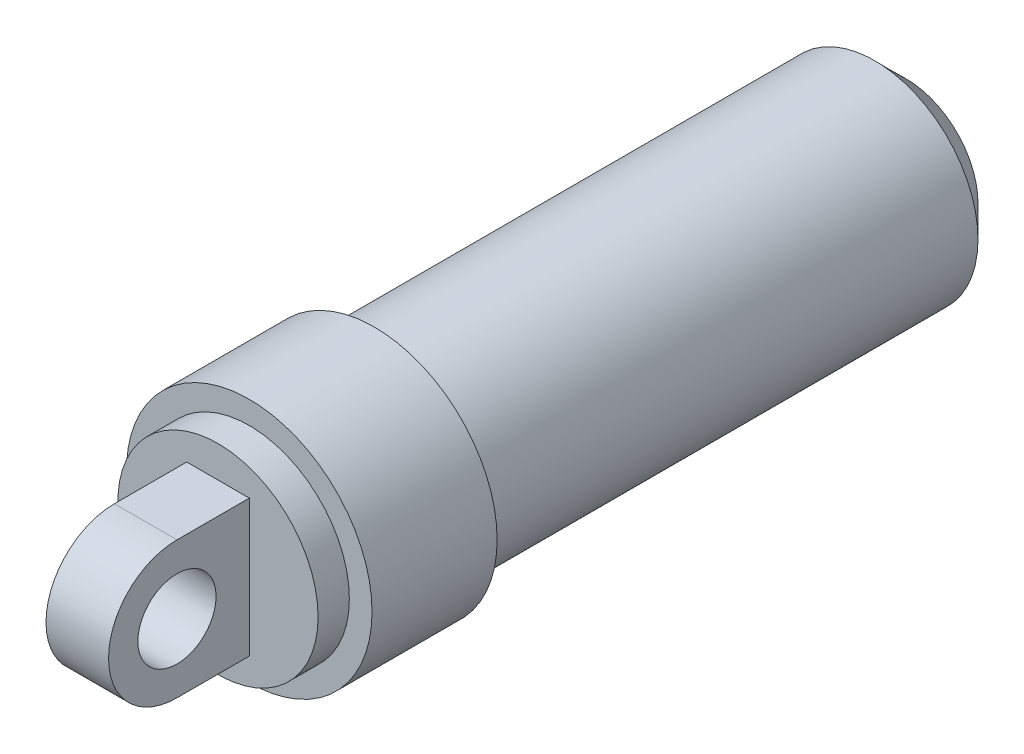
ISO-10303-21;
HEADER;
FILE_DESCRIPTION(('STEP AP214'),'2;1');
FILE_NAME('part.step','',(''),(''),'','','');
FILE_SCHEMA(('AUTOMOTIVE_DESIGN { 1 0 10303 214 1 1 1 1 }'));
ENDSEC;
DATA;
#1=APPLICATION_CONTEXT('core data for automotive mechanical design processes');
#2=APPLICATION_PROTOCOL_DEFINITION('international standard','automotive_design',2000,#1);
#3=PRODUCT_CONTEXT('',#1,'mechanical');
#4=PRODUCT('Part','Part','',(#3));
#5=PRODUCT_RELATED_PRODUCT_CATEGORY('part','',(#4));
#6=PRODUCT_DEFINITION_FORMATION('','',#4);
#7=PRODUCT_DEFINITION_CONTEXT('part definition',#1,'design');
#8=PRODUCT_DEFINITION('design','',#6,#7);
#9=PRODUCT_DEFINITION_SHAPE('','',#8);
#10=(LENGTH_UNIT() NAMED_UNIT(*) SI_UNIT(.MILLI.,.METRE.));
#11=(NAMED_UNIT(*) PLANE_ANGLE_UNIT() SI_UNIT($,.RADIAN.));
#12=(NAMED_UNIT(*) SI_UNIT($,.STERADIAN.) SOLID_ANGLE_UNIT());
#13=UNCERTAINTY_MEASURE_WITH_UNIT(LENGTH_MEASURE(1.E-05),#10,'distance_accuracy_value','');
#14=(GEOMETRIC_REPRESENTATION_CONTEXT(3) GLOBAL_UNCERTAINTY_ASSIGNED_CONTEXT((#13)) GLOBAL_UNIT_ASSIGNED_CONTEXT((#10,
#11,#12)) REPRESENTATION_CONTEXT('',''));
#15=CARTESIAN_POINT('',(0.,0.,0.));
#16=DIRECTION('',(0.,0.,1.));
#17=DIRECTION('',(1.,0.,0.));
#18=AXIS2_PLACEMENT_3D('',#15,#16,#17);
#19=CARTESIAN_POINT('',(0.,0.,44.));
#20=DIRECTION('',(0.,0.,1.));
#21=DIRECTION('',(1.,0.,0.));
#22=AXIS2_PLACEMENT_3D('',#19,#20,#21);
#23=PLANE('',#22);
#24=CARTESIAN_POINT('',(0.,0.,44.));
#25=DIRECTION('',(0.,0.,1.));
#26=DIRECTION('',(1.,0.,0.));
#27=AXIS2_PLACEMENT_3D('',#24,#25,#26);
#28=CIRCLE('',#27,6.4);
#29=CARTESIAN_POINT('',(6.4,0.,44.));
#30=VERTEX_POINT('',#29);
#31=EDGE_CURVE('E99',#30,#30,#28,.T.);
#32=ORIENTED_EDGE('',*,*,#31,.T.);
#33=EDGE_LOOP('',(#32));
#34=FACE_BOUND('',#33,.T.);
#35=DIRECTION('',(-1.,0.,0.));
#36=VECTOR('',#35,1.);
#37=CARTESIAN_POINT('',(2.,4.375,44.));
#38=LINE('',#37,#36);
#39=CARTESIAN_POINT('',(2.,4.375,44.));
#40=VERTEX_POINT('',#39);
#41=CARTESIAN_POINT('',(-2.,4.375,44.));
#42=VERTEX_POINT('',#41);
#43=EDGE_CURVE('E54',#40,#42,#38,.T.);
#44=ORIENTED_EDGE('',*,*,#43,.F.);
#45=DIRECTION('',(0.,1.,0.));
#46=VECTOR('',#45,1.);
#47=CARTESIAN_POINT('',(2.,-4.375,44.));
#48=LINE('',#47,#46);
#49=CARTESIAN_POINT('',(2.,-4.375,44.));
#50=VERTEX_POINT('',#49);
#51=EDGE_CURVE('E49',#50,#40,#48,.T.);
#52=ORIENTED_EDGE('',*,*,#51,.F.);
#53=DIRECTION('',(-1.,0.,0.));
#54=VECTOR('',#53,1.);
#55=CARTESIAN_POINT('',(2.,-4.375,44.));
#56=LINE('',#55,#54);
#57=CARTESIAN_POINT('',(-2.,-4.375,44.));
#58=VERTEX_POINT('',#57);
#59=EDGE_CURVE('E80',#50,#58,#56,.T.);
#60=ORIENTED_EDGE('',*,*,#59,.T.);
#61=DIRECTION('',(0.,1.,0.));
#62=VECTOR('',#61,1.);
#63=CARTESIAN_POINT('',(-2.,-4.375,44.));
#64=LINE('',#63,#62);
#65=EDGE_CURVE('E300',#58,#42,#64,.T.);
#66=ORIENTED_EDGE('',*,*,#65,.T.);
#67=EDGE_LOOP('',(#44,#52,#60,#66));
#68=FACE_BOUND('',#67,.T.);
#69=ADVANCED_FACE('F34',(#34,#68),#23,.T.);
#70=CARTESIAN_POINT('',(0.,0.,34.));
#71=DIRECTION('',(0.,0.,-1.));
#72=DIRECTION('',(-1.,0.,0.));
#73=AXIS2_PLACEMENT_3D('',#70,#71,#72);
#74=CYLINDRICAL_SURFACE('',#73,6.6);
#75=CARTESIAN_POINT('',(0.,0.,1.99999999999999));
#76=DIRECTION('',(0.,0.,1.));
#77=DIRECTION('',(1.,0.,0.));
#78=AXIS2_PLACEMENT_3D('',#75,#76,#77);
#79=CIRCLE('',#78,6.6);
#80=CARTESIAN_POINT('',(6.6,0.,1.99999999999999));
#81=VERTEX_POINT('',#80);
#82=EDGE_CURVE('E42',#81,#81,#79,.T.);
#83=ORIENTED_EDGE('',*,*,#82,.T.);
#84=EDGE_LOOP('',(#83));
#85=FACE_BOUND('',#84,.T.);
#86=CARTESIAN_POINT('',(0.,0.,34.));
#87=DIRECTION('',(0.,0.,1.));
#88=DIRECTION('',(1.,0.,0.));
#89=AXIS2_PLACEMENT_3D('',#86,#87,#88);
#90=CIRCLE('',#89,6.6);
#91=CARTESIAN_POINT('',(6.6,0.,34.));
#92=VERTEX_POINT('',#91);
#93=EDGE_CURVE('E110',#92,#92,#90,.T.);
#94=ORIENTED_EDGE('',*,*,#93,.F.);
#95=EDGE_LOOP('',(#94));
#96=FACE_BOUND('',#95,.T.);
#97=ADVANCED_FACE('F117',(#85,#96),#74,.T.);
#98=CARTESIAN_POINT('',(0.,0.,0.));
#99=DIRECTION('',(0.,0.,1.));
#100=DIRECTION('',(1.,0.,0.));
#101=AXIS2_PLACEMENT_3D('',#98,#99,#100);
#102=PLANE('',#101);
#103=CARTESIAN_POINT('',(0.,0.,0.));
#104=DIRECTION('',(0.,0.,-1.));
#105=DIRECTION('',(-1.,0.,0.));
#106=AXIS2_PLACEMENT_3D('',#103,#104,#105);
#107=CIRCLE('',#106,1.5);
#108=CARTESIAN_POINT('',(-1.5,0.,0.));
#109=VERTEX_POINT('',#108);
#110=EDGE_CURVE('E284',#109,#109,#107,.T.);
#111=ORIENTED_EDGE('',*,*,#110,.F.);
#112=EDGE_LOOP('',(#111));
#113=FACE_BOUND('',#112,.T.);
#114=CARTESIAN_POINT('',(0.,0.,0.));
#115=DIRECTION('',(0.,0.,1.));
#116=DIRECTION('',(1.,0.,0.));
#117=AXIS2_PLACEMENT_3D('',#114,#115,#116);
#118=CIRCLE('',#117,4.6);
#119=CARTESIAN_POINT('',(4.6,0.,0.));
#120=VERTEX_POINT('',#119);
#121=EDGE_CURVE('E11',#120,#120,#118,.F.);
#122=ORIENTED_EDGE('',*,*,#121,.T.);
#123=EDGE_LOOP('',(#122));
#124=FACE_BOUND('',#123,.T.);
#125=ADVANCED_FACE('F122',(#113,#124),#102,.F.);
#126=CARTESIAN_POINT('',(0.,0.,1.99999999999999));
#127=DIRECTION('',(0.,0.,1.));
#128=DIRECTION('',(1.,0.,0.));
#129=AXIS2_PLACEMENT_3D('',#126,#127,#128);
#130=CONICAL_SURFACE('',#129,6.6,0.785398163397451);
#131=ORIENTED_EDGE('',*,*,#121,.F.);
#132=EDGE_LOOP('',(#131));
#133=FACE_BOUND('',#132,.T.);
#134=ORIENTED_EDGE('',*,*,#82,.F.);
#135=EDGE_LOOP('',(#134));
#136=FACE_BOUND('',#135,.T.);
#137=ADVANCED_FACE('F36',(#133,#136),#130,.T.);
#138=CARTESIAN_POINT('',(0.,0.,42.));
#139=DIRECTION('',(0.,0.,-1.));
#140=DIRECTION('',(-1.,0.,0.));
#141=AXIS2_PLACEMENT_3D('',#138,#139,#140);
#142=CYLINDRICAL_SURFACE('',#141,7.85);
#143=CARTESIAN_POINT('',(0.,0.,42.));
#144=DIRECTION('',(0.,0.,1.));
#145=DIRECTION('',(1.,0.,0.));
#146=AXIS2_PLACEMENT_3D('',#143,#144,#145);
#147=CIRCLE('',#146,7.85);
#148=CARTESIAN_POINT('',(7.85,0.,42.));
#149=VERTEX_POINT('',#148);
#150=EDGE_CURVE('E107',#149,#149,#147,.T.);
#151=ORIENTED_EDGE('',*,*,#150,.F.);
#152=EDGE_LOOP('',(#151));
#153=FACE_BOUND('',#152,.T.);
#154=CARTESIAN_POINT('',(0.,0.,34.));
#155=DIRECTION('',(0.,0.,1.));
#156=DIRECTION('',(1.,0.,0.));
#157=AXIS2_PLACEMENT_3D('',#154,#155,#156);
#158=CIRCLE('',#157,7.85);
#159=CARTESIAN_POINT('',(7.85,0.,34.));
#160=VERTEX_POINT('',#159);
#161=EDGE_CURVE('E105',#160,#160,#158,.T.);
#162=ORIENTED_EDGE('',*,*,#161,.T.);
#163=EDGE_LOOP('',(#162));
#164=FACE_BOUND('',#163,.T.);
#165=ADVANCED_FACE('F121',(#153,#164),#142,.T.);
#166=CARTESIAN_POINT('',(0.,0.,42.));
#167=DIRECTION('',(0.,0.,1.));
#168=DIRECTION('',(1.,0.,0.));
#169=AXIS2_PLACEMENT_3D('',#166,#167,#168);
#170=PLANE('',#169);
#171=CARTESIAN_POINT('',(0.,0.,42.));
#172=DIRECTION('',(0.,0.,1.));
#173=DIRECTION('',(1.,0.,0.));
#174=AXIS2_PLACEMENT_3D('',#171,#172,#173);
#175=CIRCLE('',#174,6.4);
#176=CARTESIAN_POINT('',(6.4,0.,42.));
#177=VERTEX_POINT('',#176);
#178=EDGE_CURVE('E96',#177,#177,#175,.T.);
#179=ORIENTED_EDGE('',*,*,#178,.F.);
#180=EDGE_LOOP('',(#179));
#181=FACE_BOUND('',#180,.T.);
#182=ORIENTED_EDGE('',*,*,#150,.T.);
#183=EDGE_LOOP('',(#182));
#184=FACE_BOUND('',#183,.T.);
#185=ADVANCED_FACE('F128',(#181,#184),#170,.T.);
#186=CARTESIAN_POINT('',(0.,0.,34.));
#187=DIRECTION('',(0.,0.,1.));
#188=DIRECTION('',(1.,0.,0.));
#189=AXIS2_PLACEMENT_3D('',#186,#187,#188);
#190=PLANE('',#189);
#191=ORIENTED_EDGE('',*,*,#93,.T.);
#192=EDGE_LOOP('',(#191));
#193=FACE_BOUND('',#192,.T.);
#194=ORIENTED_EDGE('',*,*,#161,.F.);
#195=EDGE_LOOP('',(#194));
#196=FACE_BOUND('',#195,.T.);
#197=ADVANCED_FACE('F146',(#193,#196),#190,.F.);
#198=CARTESIAN_POINT('',(0.,0.,44.));
#199=DIRECTION('',(0.,0.,-1.));
#200=DIRECTION('',(-1.,0.,0.));
#201=AXIS2_PLACEMENT_3D('',#198,#199,#200);
#202=CYLINDRICAL_SURFACE('',#201,6.4);
#203=ORIENTED_EDGE('',*,*,#31,.F.);
#204=EDGE_LOOP('',(#203));
#205=FACE_BOUND('',#204,.T.);
#206=ORIENTED_EDGE('',*,*,#178,.T.);
#207=EDGE_LOOP('',(#206));
#208=FACE_BOUND('',#207,.T.);
#209=ADVANCED_FACE('F143',(#205,#208),#202,.T.);
#210=CARTESIAN_POINT('',(2.,0.,48.625));
#211=DIRECTION('',(-1.,0.,0.));
#212=DIRECTION('',(0.,0.,1.));
#213=AXIS2_PLACEMENT_3D('',#210,#211,#212);
#214=CYLINDRICAL_SURFACE('',#213,4.375);
#215=CARTESIAN_POINT('',(-2.,0.,48.625));
#216=DIRECTION('',(1.,0.,0.));
#217=DIRECTION('',(0.,0.,1.));
#218=AXIS2_PLACEMENT_3D('',#215,#216,#217);
#219=CIRCLE('',#218,4.375);
#220=CARTESIAN_POINT('',(-2.,4.375,48.625));
#221=VERTEX_POINT('',#220);
#222=CARTESIAN_POINT('',(-2.,-4.375,48.625));
#223=VERTEX_POINT('',#222);
#224=EDGE_CURVE('E95',#221,#223,#219,.T.);
#225=ORIENTED_EDGE('',*,*,#224,.T.);
#226=DIRECTION('',(-1.,0.,0.));
#227=VECTOR('',#226,1.);
#228=CARTESIAN_POINT('',(2.,-4.375,48.625));
#229=LINE('',#228,#227);
#230=CARTESIAN_POINT('',(2.,-4.375,48.625));
#231=VERTEX_POINT('',#230);
#232=EDGE_CURVE('E78',#231,#223,#229,.T.);
#233=ORIENTED_EDGE('',*,*,#232,.F.);
#234=CARTESIAN_POINT('',(2.,0.,48.625));
#235=DIRECTION('',(1.,0.,0.));
#236=DIRECTION('',(0.,0.,1.));
#237=AXIS2_PLACEMENT_3D('',#234,#235,#236);
#238=CIRCLE('',#237,4.375);
#239=CARTESIAN_POINT('',(2.,4.375,48.625));
#240=VERTEX_POINT('',#239);
#241=EDGE_CURVE('E82',#240,#231,#238,.T.);
#242=ORIENTED_EDGE('',*,*,#241,.F.);
#243=DIRECTION('',(-1.,0.,0.));
#244=VECTOR('',#243,1.);
#245=CARTESIAN_POINT('',(2.,4.375,48.625));
#246=LINE('',#245,#244);
#247=EDGE_CURVE('E296',#240,#221,#246,.T.);
#248=ORIENTED_EDGE('',*,*,#247,.T.);
#249=EDGE_LOOP('',(#225,#233,#242,#248));
#250=FACE_BOUND('',#249,.T.);
#251=ADVANCED_FACE('F93',(#250),#214,.T.);
#252=CARTESIAN_POINT('',(2.,-4.375,48.625));
#253=DIRECTION('',(0.,1.,0.));
#254=DIRECTION('',(0.,0.,1.));
#255=AXIS2_PLACEMENT_3D('',#252,#253,#254);
#256=PLANE('',#255);
#257=DIRECTION('',(0.,0.,-1.));
#258=VECTOR('',#257,1.);
#259=CARTESIAN_POINT('',(-2.,-4.375,48.625));
#260=LINE('',#259,#258);
#261=EDGE_CURVE('E298',#223,#58,#260,.T.);
#262=ORIENTED_EDGE('',*,*,#261,.T.);
#263=ORIENTED_EDGE('',*,*,#59,.F.);
#264=DIRECTION('',(0.,0.,-1.));
#265=VECTOR('',#264,1.);
#266=CARTESIAN_POINT('',(2.,-4.375,48.625));
#267=LINE('',#266,#265);
#268=EDGE_CURVE('E73',#231,#50,#267,.T.);
#269=ORIENTED_EDGE('',*,*,#268,.F.);
#270=ORIENTED_EDGE('',*,*,#232,.T.);
#271=EDGE_LOOP('',(#262,#263,#269,#270));
#272=FACE_BOUND('',#271,.T.);
#273=ADVANCED_FACE('F76',(#272),#256,.F.);
#274=CARTESIAN_POINT('',(2.,4.375,44.));
#275=DIRECTION('',(0.,-1.,0.));
#276=DIRECTION('',(0.,0.,-1.));
#277=AXIS2_PLACEMENT_3D('',#274,#275,#276);
#278=PLANE('',#277);
#279=DIRECTION('',(0.,0.,1.));
#280=VECTOR('',#279,1.);
#281=CARTESIAN_POINT('',(-2.,4.375,44.));
#282=LINE('',#281,#280);
#283=EDGE_CURVE('E91',#42,#221,#282,.T.);
#284=ORIENTED_EDGE('',*,*,#283,.T.);
#285=ORIENTED_EDGE('',*,*,#247,.F.);
#286=DIRECTION('',(0.,0.,1.));
#287=VECTOR('',#286,1.);
#288=CARTESIAN_POINT('',(2.,4.375,44.));
#289=LINE('',#288,#287);
#290=EDGE_CURVE('E87',#40,#240,#289,.T.);
#291=ORIENTED_EDGE('',*,*,#290,.F.);
#292=ORIENTED_EDGE('',*,*,#43,.T.);
#293=EDGE_LOOP('',(#284,#285,#291,#292));
#294=FACE_BOUND('',#293,.T.);
#295=ADVANCED_FACE('F177',(#294),#278,.F.);
#296=CARTESIAN_POINT('',(2.,0.,48.625));
#297=DIRECTION('',(-1.,0.,0.));
#298=DIRECTION('',(0.,0.,1.));
#299=AXIS2_PLACEMENT_3D('',#296,#297,#298);
#300=PLANE('',#299);
#301=CARTESIAN_POINT('',(2.,0.,48.625));
#302=DIRECTION('',(-1.,0.,0.));
#303=DIRECTION('',(0.,0.,1.));
#304=AXIS2_PLACEMENT_3D('',#301,#302,#303);
#305=CIRCLE('',#304,2.5);
#306=CARTESIAN_POINT('',(2.,0.,51.125));
#307=VERTEX_POINT('',#306);
#308=EDGE_CURVE('E287',#307,#307,#305,.T.);
#309=ORIENTED_EDGE('',*,*,#308,.T.);
#310=EDGE_LOOP('',(#309));
#311=FACE_BOUND('',#310,.T.);
#312=ORIENTED_EDGE('',*,*,#241,.T.);
#313=ORIENTED_EDGE('',*,*,#268,.T.);
#314=ORIENTED_EDGE('',*,*,#51,.T.);
#315=ORIENTED_EDGE('',*,*,#290,.T.);
#316=EDGE_LOOP('',(#312,#313,#314,#315));
#317=FACE_BOUND('',#316,.T.);
#318=ADVANCED_FACE('F85',(#311,#317),#300,.F.);
#319=CARTESIAN_POINT('',(-2.,0.,48.625));
#320=DIRECTION('',(-1.,0.,0.));
#321=DIRECTION('',(0.,0.,1.));
#322=AXIS2_PLACEMENT_3D('',#319,#320,#321);
#323=PLANE('',#322);
#324=CARTESIAN_POINT('',(-2.,0.,48.625));
#325=DIRECTION('',(-1.,0.,0.));
#326=DIRECTION('',(0.,0.,1.));
#327=AXIS2_PLACEMENT_3D('',#324,#325,#326);
#328=CIRCLE('',#327,2.5);
#329=CARTESIAN_POINT('',(-2.,0.,51.125));
#330=VERTEX_POINT('',#329);
#331=EDGE_CURVE('E283',#330,#330,#328,.T.);
#332=ORIENTED_EDGE('',*,*,#331,.F.);
#333=EDGE_LOOP('',(#332));
#334=FACE_BOUND('',#333,.T.);
#335=ORIENTED_EDGE('',*,*,#224,.F.);
#336=ORIENTED_EDGE('',*,*,#283,.F.);
#337=ORIENTED_EDGE('',*,*,#65,.F.);
#338=ORIENTED_EDGE('',*,*,#261,.F.);
#339=EDGE_LOOP('',(#335,#336,#337,#338));
#340=FACE_BOUND('',#339,.T.);
#341=ADVANCED_FACE('F190',(#334,#340),#323,.T.);
#342=CARTESIAN_POINT('',(2.,0.,48.625));
#343=DIRECTION('',(-1.,0.,0.));
#344=DIRECTION('',(0.,0.,1.));
#345=AXIS2_PLACEMENT_3D('',#342,#343,#344);
#346=CYLINDRICAL_SURFACE('',#345,2.5);
#347=ORIENTED_EDGE('',*,*,#308,.F.);
#348=EDGE_LOOP('',(#347));
#349=FACE_BOUND('',#348,.T.);
#350=ORIENTED_EDGE('',*,*,#331,.T.);
#351=EDGE_LOOP('',(#350));
#352=FACE_BOUND('',#351,.T.);
#353=ADVANCED_FACE('F198',(#349,#352),#346,.F.);
#354=CARTESIAN_POINT('',(0.,0.,35.));
#355=DIRECTION('',(0.,0.,-1.));
#356=DIRECTION('',(-1.,0.,0.));
#357=AXIS2_PLACEMENT_3D('',#354,#355,#356);
#358=CYLINDRICAL_SURFACE('',#357,1.5);
#359=CARTESIAN_POINT('',(0.,0.,35.));
#360=DIRECTION('',(0.,0.,-1.));
#361=DIRECTION('',(-1.,0.,0.));
#362=AXIS2_PLACEMENT_3D('',#359,#360,#361);
#363=CIRCLE('',#362,1.5);
#364=CARTESIAN_POINT('',(-1.5,0.,35.));
#365=VERTEX_POINT('',#364);
#366=EDGE_CURVE('E282',#365,#365,#363,.T.);
#367=ORIENTED_EDGE('',*,*,#366,.F.);
#368=EDGE_LOOP('',(#367));
#369=FACE_BOUND('',#368,.T.);
#370=ORIENTED_EDGE('',*,*,#110,.T.);
#371=EDGE_LOOP('',(#370));
#372=FACE_BOUND('',#371,.T.);
#373=ADVANCED_FACE('F206',(#369,#372),#358,.F.);
#374=CARTESIAN_POINT('',(0.,0.,35.));
#375=DIRECTION('',(0.,0.,-1.));
#376=DIRECTION('',(-1.,0.,0.));
#377=AXIS2_PLACEMENT_3D('',#374,#375,#376);
#378=PLANE('',#377);
#379=ORIENTED_EDGE('',*,*,#366,.T.);
#380=EDGE_LOOP('',(#379));
#381=FACE_BOUND('',#380,.T.);
#382=ADVANCED_FACE('F215',(#381),#378,.T.);
#383=CLOSED_SHELL('',(#69,#97,#125,#137,#165,#185,#197,#209,#251,#273,#295,#318,#341,#353,#373,#382));
#384=MANIFOLD_SOLID_BREP('B2',#383);
#385=ADVANCED_BREP_SHAPE_REPRESENTATION('',(#18,#384),#14);
#386=SHAPE_DEFINITION_REPRESENTATION(#9,#385);
ENDSEC;
END-ISO-10303-21;
